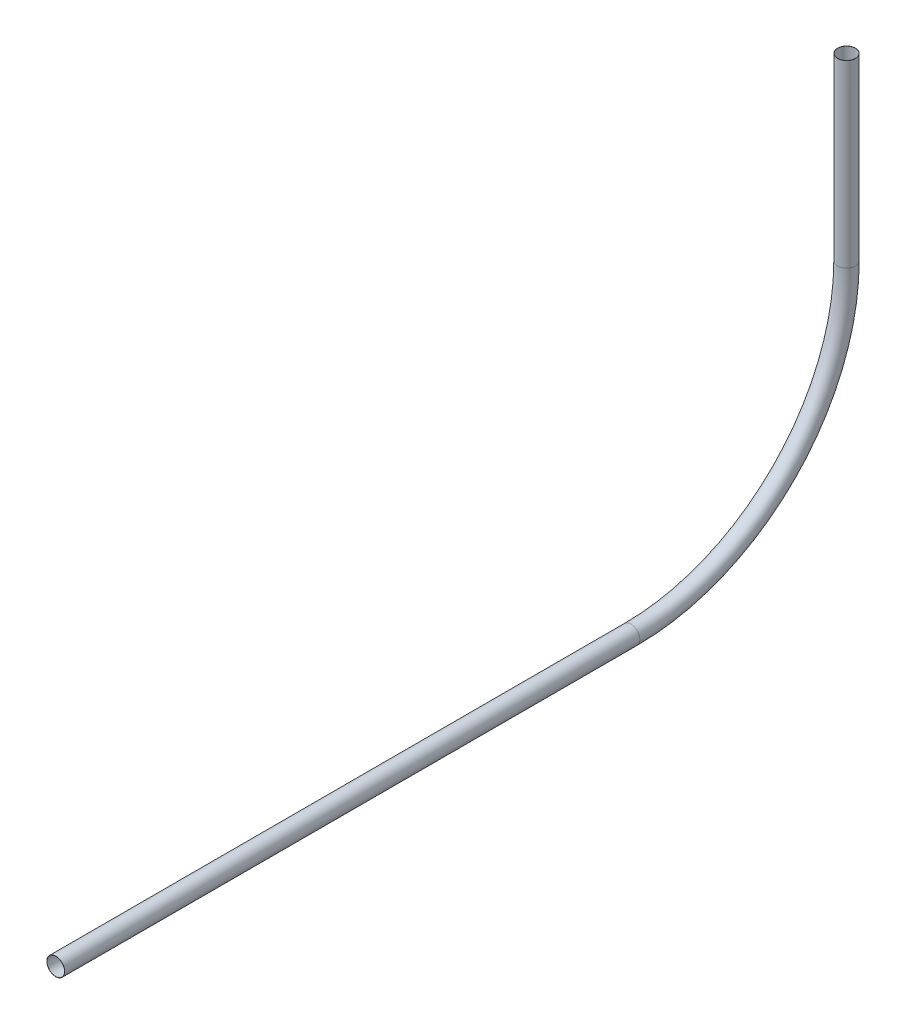
ISO-10303-21;
HEADER;
FILE_DESCRIPTION(('STEP AP214'),'2;1');
FILE_NAME('part.step','',(''),(''),'','','');
FILE_SCHEMA(('AUTOMOTIVE_DESIGN { 1 0 10303 214 1 1 1 1 }'));
ENDSEC;
DATA;
#1=APPLICATION_CONTEXT('core data for automotive mechanical design processes');
#2=APPLICATION_PROTOCOL_DEFINITION('international standard','automotive_design',2000,#1);
#3=PRODUCT_CONTEXT('',#1,'mechanical');
#4=PRODUCT('Part','Part','',(#3));
#5=PRODUCT_RELATED_PRODUCT_CATEGORY('part','',(#4));
#6=PRODUCT_DEFINITION_FORMATION('','',#4);
#7=PRODUCT_DEFINITION_CONTEXT('part definition',#1,'design');
#8=PRODUCT_DEFINITION('design','',#6,#7);
#9=PRODUCT_DEFINITION_SHAPE('','',#8);
#10=(LENGTH_UNIT() NAMED_UNIT(*) SI_UNIT(.MILLI.,.METRE.));
#11=(NAMED_UNIT(*) PLANE_ANGLE_UNIT() SI_UNIT($,.RADIAN.));
#12=(NAMED_UNIT(*) SI_UNIT($,.STERADIAN.) SOLID_ANGLE_UNIT());
#13=UNCERTAINTY_MEASURE_WITH_UNIT(LENGTH_MEASURE(1.E-05),#10,'distance_accuracy_value','');
#14=(GEOMETRIC_REPRESENTATION_CONTEXT(3) GLOBAL_UNCERTAINTY_ASSIGNED_CONTEXT((#13)) GLOBAL_UNIT_ASSIGNED_CONTEXT((#10,
#11,#12)) REPRESENTATION_CONTEXT('',''));
#15=CARTESIAN_POINT('',(0.,0.,0.));
#16=DIRECTION('',(0.,0.,1.));
#17=DIRECTION('',(1.,0.,0.));
#18=AXIS2_PLACEMENT_3D('',#15,#16,#17);
#19=CARTESIAN_POINT('',(0.,0.,0.));
#20=DIRECTION('',(0.,-1.,0.));
#21=DIRECTION('',(0.,0.,-1.));
#22=AXIS2_PLACEMENT_3D('',#19,#20,#21);
#23=CYLINDRICAL_SURFACE('',#22,1.5875);
#24=CARTESIAN_POINT('',(0.,-31.75,0.));
#25=DIRECTION('',(0.,1.,0.));
#26=DIRECTION('',(0.,0.,1.));
#27=AXIS2_PLACEMENT_3D('',#24,#25,#26);
#28=CIRCLE('',#27,1.5875);
#29=CARTESIAN_POINT('',(0.,-31.75,-1.58749999999999));
#30=VERTEX_POINT('',#29);
#31=EDGE_CURVE('E64',#30,#30,#28,.T.);
#32=ORIENTED_EDGE('',*,*,#31,.T.);
#33=EDGE_LOOP('',(#32));
#34=FACE_BOUND('',#33,.T.);
#35=CARTESIAN_POINT('',(0.,0.,0.));
#36=DIRECTION('',(0.,1.,0.));
#37=DIRECTION('',(0.,0.,1.));
#38=AXIS2_PLACEMENT_3D('',#35,#36,#37);
#39=CIRCLE('',#38,1.5875);
#40=CARTESIAN_POINT('',(0.,0.,1.5875));
#41=VERTEX_POINT('',#40);
#42=EDGE_CURVE('E61',#41,#41,#39,.T.);
#43=ORIENTED_EDGE('',*,*,#42,.F.);
#44=EDGE_LOOP('',(#43));
#45=FACE_BOUND('',#44,.T.);
#46=ADVANCED_FACE('F37',(#34,#45),#23,.T.);
#47=CARTESIAN_POINT('',(0.,-31.75,38.1));
#48=DIRECTION('',(-1.,0.,0.));
#49=DIRECTION('',(0.,0.,1.));
#50=AXIS2_PLACEMENT_3D('',#47,#48,#49);
#51=TOROIDAL_SURFACE('',#50,38.1,1.5875);
#52=CARTESIAN_POINT('',(0.,-69.85,38.1));
#53=DIRECTION('',(0.,0.,-1.));
#54=DIRECTION('',(0.,1.,0.));
#55=AXIS2_PLACEMENT_3D('',#52,#53,#54);
#56=CIRCLE('',#55,1.5875);
#57=CARTESIAN_POINT('',(0.,-71.4375,38.1));
#58=VERTEX_POINT('',#57);
#59=EDGE_CURVE('E41',#58,#58,#56,.T.);
#60=CARTESIAN_POINT('',(0.,-31.75,38.1));
#61=DIRECTION('',(-1.,0.,0.));
#62=DIRECTION('',(0.,0.,1.));
#63=AXIS2_PLACEMENT_3D('',#60,#61,#62);
#64=CIRCLE('',#63,39.6875);
#65=EDGE_CURVE('',#30,#58,#64,.T.);
#66=ORIENTED_EDGE('',*,*,#31,.F.);
#67=ORIENTED_EDGE('',*,*,#59,.T.);
#68=ORIENTED_EDGE('',*,*,#65,.T.);
#69=ORIENTED_EDGE('',*,*,#65,.F.);
#70=EDGE_LOOP('',(#66,#68,#67,#69));
#71=FACE_BOUND('',#70,.T.);
#72=ADVANCED_FACE('F73',(#71),#51,.T.);
#73=CARTESIAN_POINT('',(0.,-69.85,38.1));
#74=DIRECTION('',(0.,0.,1.));
#75=DIRECTION('',(0.,-1.,0.));
#76=AXIS2_PLACEMENT_3D('',#73,#74,#75);
#77=CYLINDRICAL_SURFACE('',#76,1.5875);
#78=CARTESIAN_POINT('',(0.,-69.85,139.7));
#79=DIRECTION('',(0.,0.,-1.));
#80=DIRECTION('',(0.,1.,0.));
#81=AXIS2_PLACEMENT_3D('',#78,#79,#80);
#82=CIRCLE('',#81,1.5875);
#83=CARTESIAN_POINT('',(0.,-68.2625,139.7));
#84=VERTEX_POINT('',#83);
#85=EDGE_CURVE('E56',#84,#84,#82,.T.);
#86=ORIENTED_EDGE('',*,*,#85,.T.);
#87=EDGE_LOOP('',(#86));
#88=FACE_BOUND('',#87,.T.);
#89=ORIENTED_EDGE('',*,*,#59,.F.);
#90=EDGE_LOOP('',(#89));
#91=FACE_BOUND('',#90,.T.);
#92=ADVANCED_FACE('F39',(#88,#91),#77,.T.);
#93=CARTESIAN_POINT('',(0.,0.,0.));
#94=DIRECTION('',(0.,1.,0.));
#95=DIRECTION('',(0.,0.,1.));
#96=AXIS2_PLACEMENT_3D('',#93,#94,#95);
#97=PLANE('',#96);
#98=CARTESIAN_POINT('',(0.,0.,0.));
#99=DIRECTION('',(0.,1.,0.));
#100=DIRECTION('',(0.,0.,1.));
#101=AXIS2_PLACEMENT_3D('',#98,#99,#100);
#102=CIRCLE('',#101,1.5494);
#103=CARTESIAN_POINT('',(0.,0.,1.5494));
#104=VERTEX_POINT('',#103);
#105=EDGE_CURVE('E60',#104,#104,#102,.F.);
#106=ORIENTED_EDGE('',*,*,#105,.T.);
#107=EDGE_LOOP('',(#106));
#108=FACE_BOUND('',#107,.T.);
#109=ORIENTED_EDGE('',*,*,#42,.T.);
#110=EDGE_LOOP('',(#109));
#111=FACE_BOUND('',#110,.T.);
#112=ADVANCED_FACE('F77',(#108,#111),#97,.T.);
#113=CARTESIAN_POINT('',(0.,-69.85,139.7));
#114=DIRECTION('',(0.,0.,-1.));
#115=DIRECTION('',(0.,1.,0.));
#116=AXIS2_PLACEMENT_3D('',#113,#114,#115);
#117=PLANE('',#116);
#118=CARTESIAN_POINT('',(0.,-69.85,139.7));
#119=DIRECTION('',(0.,0.,-1.));
#120=DIRECTION('',(0.,1.,0.));
#121=AXIS2_PLACEMENT_3D('',#118,#119,#120);
#122=CIRCLE('',#121,1.5494);
#123=CARTESIAN_POINT('',(0.,-68.3006,139.7));
#124=VERTEX_POINT('',#123);
#125=EDGE_CURVE('E10',#124,#124,#122,.F.);
#126=ORIENTED_EDGE('',*,*,#125,.F.);
#127=EDGE_LOOP('',(#126));
#128=FACE_BOUND('',#127,.T.);
#129=ORIENTED_EDGE('',*,*,#85,.F.);
#130=EDGE_LOOP('',(#129));
#131=FACE_BOUND('',#130,.T.);
#132=ADVANCED_FACE('F83',(#128,#131),#117,.F.);
#133=CARTESIAN_POINT('',(0.,0.,0.));
#134=DIRECTION('',(0.,-1.,0.));
#135=DIRECTION('',(0.,0.,-1.));
#136=AXIS2_PLACEMENT_3D('',#133,#134,#135);
#137=CYLINDRICAL_SURFACE('',#136,1.5494);
#138=CARTESIAN_POINT('',(0.,-31.75,0.));
#139=DIRECTION('',(0.,1.,0.));
#140=DIRECTION('',(0.,0.,1.));
#141=AXIS2_PLACEMENT_3D('',#138,#139,#140);
#142=CIRCLE('',#141,1.5494);
#143=CARTESIAN_POINT('',(0.,-31.75,-1.54939999999999));
#144=VERTEX_POINT('',#143);
#145=EDGE_CURVE('E52',#144,#144,#142,.F.);
#146=ORIENTED_EDGE('',*,*,#145,.T.);
#147=EDGE_LOOP('',(#146));
#148=FACE_BOUND('',#147,.T.);
#149=ORIENTED_EDGE('',*,*,#105,.F.);
#150=EDGE_LOOP('',(#149));
#151=FACE_BOUND('',#150,.T.);
#152=ADVANCED_FACE('F93',(#148,#151),#137,.F.);
#153=CARTESIAN_POINT('',(0.,-31.75,38.1));
#154=DIRECTION('',(-1.,0.,0.));
#155=DIRECTION('',(0.,0.,1.));
#156=AXIS2_PLACEMENT_3D('',#153,#154,#155);
#157=TOROIDAL_SURFACE('',#156,38.1,1.5494);
#158=CARTESIAN_POINT('',(0.,-69.85,38.1));
#159=DIRECTION('',(0.,0.,-1.));
#160=DIRECTION('',(0.,1.,0.));
#161=AXIS2_PLACEMENT_3D('',#158,#159,#160);
#162=CIRCLE('',#161,1.5494);
#163=CARTESIAN_POINT('',(0.,-71.3994,38.1));
#164=VERTEX_POINT('',#163);
#165=EDGE_CURVE('E46',#164,#164,#162,.F.);
#166=CARTESIAN_POINT('',(0.,-31.75,38.1));
#167=DIRECTION('',(-1.,0.,0.));
#168=DIRECTION('',(0.,0.,1.));
#169=AXIS2_PLACEMENT_3D('',#166,#167,#168);
#170=CIRCLE('',#169,39.6494);
#171=EDGE_CURVE('',#144,#164,#170,.T.);
#172=ORIENTED_EDGE('',*,*,#145,.F.);
#173=ORIENTED_EDGE('',*,*,#165,.T.);
#174=ORIENTED_EDGE('',*,*,#171,.T.);
#175=ORIENTED_EDGE('',*,*,#171,.F.);
#176=EDGE_LOOP('',(#172,#174,#173,#175));
#177=FACE_BOUND('',#176,.T.);
#178=ADVANCED_FACE('F88',(#177),#157,.F.);
#179=CARTESIAN_POINT('',(0.,-69.85,38.1));
#180=DIRECTION('',(0.,0.,1.));
#181=DIRECTION('',(0.,-1.,0.));
#182=AXIS2_PLACEMENT_3D('',#179,#180,#181);
#183=CYLINDRICAL_SURFACE('',#182,1.5494);
#184=ORIENTED_EDGE('',*,*,#125,.T.);
#185=EDGE_LOOP('',(#184));
#186=FACE_BOUND('',#185,.T.);
#187=ORIENTED_EDGE('',*,*,#165,.F.);
#188=EDGE_LOOP('',(#187));
#189=FACE_BOUND('',#188,.T.);
#190=ADVANCED_FACE('F86',(#186,#189),#183,.F.);
#191=CLOSED_SHELL('',(#46,#72,#92,#112,#132,#152,#178,#190));
#192=MANIFOLD_SOLID_BREP('B2',#191);
#193=ADVANCED_BREP_SHAPE_REPRESENTATION('',(#18,#192),#14);
#194=SHAPE_DEFINITION_REPRESENTATION(#9,#193);
ENDSEC;
END-ISO-10303-21;
